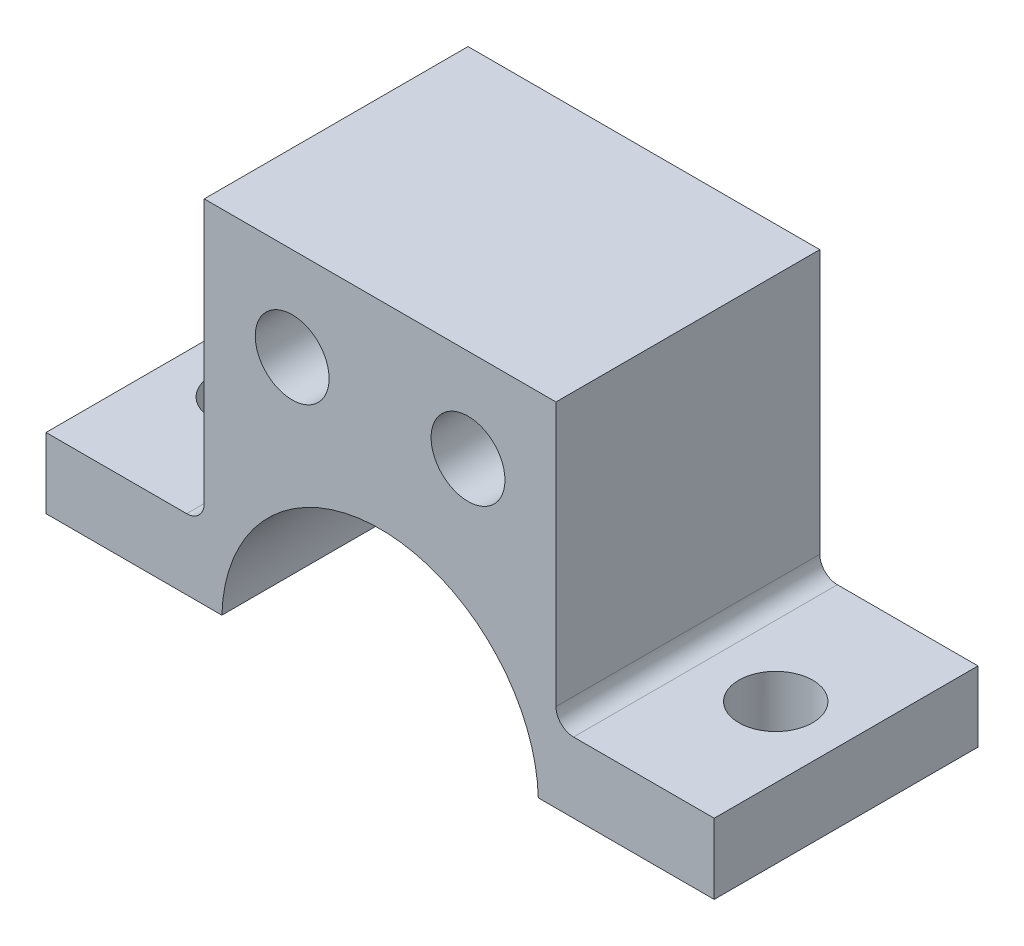
ISO-10303-21;
HEADER;
FILE_DESCRIPTION(('STEP AP214'),'2;1');
FILE_NAME('part.step','',(''),(''),'','','');
FILE_SCHEMA(('AUTOMOTIVE_DESIGN { 1 0 10303 214 1 1 1 1 }'));
ENDSEC;
DATA;
#1=APPLICATION_CONTEXT('core data for automotive mechanical design processes');
#2=APPLICATION_PROTOCOL_DEFINITION('international standard','automotive_design',2000,#1);
#3=PRODUCT_CONTEXT('',#1,'mechanical');
#4=PRODUCT('Part','Part','',(#3));
#5=PRODUCT_RELATED_PRODUCT_CATEGORY('part','',(#4));
#6=PRODUCT_DEFINITION_FORMATION('','',#4);
#7=PRODUCT_DEFINITION_CONTEXT('part definition',#1,'design');
#8=PRODUCT_DEFINITION('design','',#6,#7);
#9=PRODUCT_DEFINITION_SHAPE('','',#8);
#10=(LENGTH_UNIT() NAMED_UNIT(*) SI_UNIT(.MILLI.,.METRE.));
#11=(NAMED_UNIT(*) PLANE_ANGLE_UNIT() SI_UNIT($,.RADIAN.));
#12=(NAMED_UNIT(*) SI_UNIT($,.STERADIAN.) SOLID_ANGLE_UNIT());
#13=UNCERTAINTY_MEASURE_WITH_UNIT(LENGTH_MEASURE(1.E-05),#10,'distance_accuracy_value','');
#14=(GEOMETRIC_REPRESENTATION_CONTEXT(3) GLOBAL_UNCERTAINTY_ASSIGNED_CONTEXT((#13)) GLOBAL_UNIT_ASSIGNED_CONTEXT((#10,
#11,#12)) REPRESENTATION_CONTEXT('',''));
#15=CARTESIAN_POINT('',(0.,0.,0.));
#16=DIRECTION('',(0.,0.,1.));
#17=DIRECTION('',(1.,0.,0.));
#18=AXIS2_PLACEMENT_3D('',#15,#16,#17);
#19=CARTESIAN_POINT('',(9.99999999999999,-20.25,14.9999999999999));
#20=DIRECTION('',(0.,0.,-1.));
#21=DIRECTION('',(-1.00000000000001,0.,0.));
#22=AXIS2_PLACEMENT_3D('',#19,#20,#21);
#23=CYLINDRICAL_SURFACE('',#22,9.);
#24=CARTESIAN_POINT('',(10.,-20.25,0.));
#25=DIRECTION('',(0.,0.,1.));
#26=DIRECTION('',(1.00000000000001,0.,0.));
#27=AXIS2_PLACEMENT_3D('',#24,#25,#26);
#28=CIRCLE('',#27,9.);
#29=CARTESIAN_POINT('',(18.9965271077233,-20.,0.));
#30=VERTEX_POINT('',#29);
#31=CARTESIAN_POINT('',(1.00347289227671,-20.,0.));
#32=VERTEX_POINT('',#31);
#33=EDGE_CURVE('E126',#30,#32,#28,.T.);
#34=ORIENTED_EDGE('',*,*,#33,.F.);
#35=DIRECTION('',(0.,0.,-1.));
#36=VECTOR('',#35,1.);
#37=CARTESIAN_POINT('',(18.9965271077234,-20.,14.9999999999998));
#38=LINE('',#37,#36);
#39=CARTESIAN_POINT('',(18.9965271077234,-20.,14.9999999999998));
#40=VERTEX_POINT('',#39);
#41=EDGE_CURVE('E121',#40,#30,#38,.T.);
#42=ORIENTED_EDGE('',*,*,#41,.F.);
#43=CARTESIAN_POINT('',(9.99999999999999,-20.25,14.9999999999999));
#44=DIRECTION('',(0.,0.,1.));
#45=DIRECTION('',(1.00000000000001,0.,0.));
#46=AXIS2_PLACEMENT_3D('',#43,#44,#45);
#47=CIRCLE('',#46,9.);
#48=CARTESIAN_POINT('',(1.00347289227671,-20.,14.9999999999998));
#49=VERTEX_POINT('',#48);
#50=EDGE_CURVE('E123',#40,#49,#47,.T.);
#51=ORIENTED_EDGE('',*,*,#50,.T.);
#52=DIRECTION('',(0.,0.,-1.));
#53=VECTOR('',#52,1.);
#54=CARTESIAN_POINT('',(1.00347289227671,-20.,14.9999999999998));
#55=LINE('',#54,#53);
#56=EDGE_CURVE('E167',#49,#32,#55,.T.);
#57=ORIENTED_EDGE('',*,*,#56,.T.);
#58=EDGE_LOOP('',(#34,#42,#51,#57));
#59=FACE_BOUND('',#58,.T.);
#60=ADVANCED_FACE('F34',(#59),#23,.F.);
#61=CARTESIAN_POINT('',(0.,-20.,14.9999999999998));
#62=DIRECTION('',(0.,-1.00000000000001,0.));
#63=DIRECTION('',(0.,0.,-1.));
#64=AXIS2_PLACEMENT_3D('',#61,#62,#63);
#65=PLANE('',#64);
#66=CARTESIAN_POINT('',(24.9965271077235,-20.,7.49999999999981));
#67=DIRECTION('',(0.,-1.00000000000001,0.));
#68=DIRECTION('',(0.,0.,-1.));
#69=AXIS2_PLACEMENT_3D('',#66,#67,#68);
#70=CIRCLE('',#69,2.1);
#71=CARTESIAN_POINT('',(24.9965271077235,-20.,5.3999999999998));
#72=VERTEX_POINT('',#71);
#73=EDGE_CURVE('E325',#72,#72,#70,.T.);
#74=ORIENTED_EDGE('',*,*,#73,.F.);
#75=EDGE_LOOP('',(#74));
#76=FACE_BOUND('',#75,.T.);
#77=DIRECTION('',(-1.00000000000001,0.,0.));
#78=VECTOR('',#77,1.);
#79=CARTESIAN_POINT('',(0.,-20.,0.));
#80=LINE('',#79,#78);
#81=CARTESIAN_POINT('',(28.9965271077235,-20.,0.));
#82=VERTEX_POINT('',#81);
#83=EDGE_CURVE('E176',#82,#30,#80,.T.);
#84=ORIENTED_EDGE('',*,*,#83,.F.);
#85=DIRECTION('',(0.,0.,-1.));
#86=VECTOR('',#85,1.);
#87=CARTESIAN_POINT('',(28.9965271077235,-20.,14.9999999999998));
#88=LINE('',#87,#86);
#89=CARTESIAN_POINT('',(28.9965271077235,-20.,14.9999999999998));
#90=VERTEX_POINT('',#89);
#91=EDGE_CURVE('E132',#90,#82,#88,.T.);
#92=ORIENTED_EDGE('',*,*,#91,.F.);
#93=DIRECTION('',(-1.00000000000001,0.,0.));
#94=VECTOR('',#93,1.);
#95=CARTESIAN_POINT('',(0.,-20.,14.9999999999998));
#96=LINE('',#95,#94);
#97=EDGE_CURVE('E138',#90,#40,#96,.T.);
#98=ORIENTED_EDGE('',*,*,#97,.T.);
#99=ORIENTED_EDGE('',*,*,#41,.T.);
#100=EDGE_LOOP('',(#84,#92,#98,#99));
#101=FACE_BOUND('',#100,.T.);
#102=ADVANCED_FACE('F145',(#76,#101),#65,.T.);
#103=CARTESIAN_POINT('',(28.9965271077235,0.,14.9999999999999));
#104=DIRECTION('',(1.00000000000001,0.,0.));
#105=DIRECTION('',(0.,0.,-1.));
#106=AXIS2_PLACEMENT_3D('',#103,#104,#105);
#107=PLANE('',#106);
#108=DIRECTION('',(0.,-1.00000000000001,0.));
#109=VECTOR('',#108,1.);
#110=CARTESIAN_POINT('',(28.9965271077235,0.,0.));
#111=LINE('',#110,#109);
#112=CARTESIAN_POINT('',(28.9965271077235,-16.,0.));
#113=VERTEX_POINT('',#112);
#114=EDGE_CURVE('E178',#113,#82,#111,.T.);
#115=ORIENTED_EDGE('',*,*,#114,.F.);
#116=DIRECTION('',(0.,0.,-1.));
#117=VECTOR('',#116,1.);
#118=CARTESIAN_POINT('',(28.9965271077235,-16.,14.9999999999998));
#119=LINE('',#118,#117);
#120=CARTESIAN_POINT('',(28.9965271077235,-16.,14.9999999999998));
#121=VERTEX_POINT('',#120);
#122=EDGE_CURVE('E210',#121,#113,#119,.T.);
#123=ORIENTED_EDGE('',*,*,#122,.F.);
#124=DIRECTION('',(0.,-1.00000000000001,0.));
#125=VECTOR('',#124,1.);
#126=CARTESIAN_POINT('',(28.9965271077235,0.,14.9999999999999));
#127=LINE('',#126,#125);
#128=EDGE_CURVE('E146',#121,#90,#127,.T.);
#129=ORIENTED_EDGE('',*,*,#128,.T.);
#130=ORIENTED_EDGE('',*,*,#91,.T.);
#131=EDGE_LOOP('',(#115,#123,#129,#130));
#132=FACE_BOUND('',#131,.T.);
#133=ADVANCED_FACE('F247',(#132),#107,.T.);
#134=CARTESIAN_POINT('',(0.,-16.,14.9999999999998));
#135=DIRECTION('',(0.,1.00000000000001,0.));
#136=DIRECTION('',(0.,0.,1.));
#137=AXIS2_PLACEMENT_3D('',#134,#135,#136);
#138=PLANE('',#137);
#139=CARTESIAN_POINT('',(24.9965271077235,-16.,7.49999999999982));
#140=DIRECTION('',(0.,1.00000000000001,0.));
#141=DIRECTION('',(0.,0.,1.));
#142=AXIS2_PLACEMENT_3D('',#139,#140,#141);
#143=CIRCLE('',#142,2.1);
#144=CARTESIAN_POINT('',(24.9965271077235,-16.,9.59999999999982));
#145=VERTEX_POINT('',#144);
#146=EDGE_CURVE('E327',#145,#145,#143,.T.);
#147=ORIENTED_EDGE('',*,*,#146,.F.);
#148=EDGE_LOOP('',(#147));
#149=FACE_BOUND('',#148,.T.);
#150=DIRECTION('',(1.00000000000001,0.,0.));
#151=VECTOR('',#150,1.);
#152=CARTESIAN_POINT('',(0.,-16.,0.));
#153=LINE('',#152,#151);
#154=CARTESIAN_POINT('',(21.,-16.,0.));
#155=VERTEX_POINT('',#154);
#156=EDGE_CURVE('E181',#155,#113,#153,.T.);
#157=ORIENTED_EDGE('',*,*,#156,.F.);
#158=DIRECTION('',(0.,0.,-1.));
#159=VECTOR('',#158,1.);
#160=CARTESIAN_POINT('',(21.0000000000001,-16.,14.9999999999998));
#161=LINE('',#160,#159);
#162=CARTESIAN_POINT('',(21.0000000000001,-16.,14.9999999999998));
#163=VERTEX_POINT('',#162);
#164=EDGE_CURVE('E219',#155,#163,#161,.F.);
#165=ORIENTED_EDGE('',*,*,#164,.T.);
#166=DIRECTION('',(1.00000000000001,0.,0.));
#167=VECTOR('',#166,1.);
#168=CARTESIAN_POINT('',(0.,-16.,14.9999999999998));
#169=LINE('',#168,#167);
#170=EDGE_CURVE('E148',#163,#121,#169,.T.);
#171=ORIENTED_EDGE('',*,*,#170,.T.);
#172=ORIENTED_EDGE('',*,*,#122,.T.);
#173=EDGE_LOOP('',(#157,#165,#171,#172));
#174=FACE_BOUND('',#173,.T.);
#175=ADVANCED_FACE('F243',(#149,#174),#138,.T.);
#176=CARTESIAN_POINT('',(20.0000000000001,0.,14.9999999999999));
#177=DIRECTION('',(-1.00000000000001,0.,0.));
#178=DIRECTION('',(0.,0.,1.));
#179=AXIS2_PLACEMENT_3D('',#176,#177,#178);
#180=PLANE('',#179);
#181=DIRECTION('',(0.,1.00000000000001,0.));
#182=VECTOR('',#181,1.);
#183=CARTESIAN_POINT('',(20.0000000000001,0.,14.9999999999999));
#184=LINE('',#183,#182);
#185=CARTESIAN_POINT('',(20.0000000000001,-15.,14.9999999999998));
#186=VERTEX_POINT('',#185);
#187=CARTESIAN_POINT('',(20.0000000000001,0.,14.9999999999999));
#188=VERTEX_POINT('',#187);
#189=EDGE_CURVE('E153',#186,#188,#184,.T.);
#190=ORIENTED_EDGE('',*,*,#189,.F.);
#191=DIRECTION('',(0.,0.,-1.));
#192=VECTOR('',#191,1.);
#193=CARTESIAN_POINT('',(20.0000000000001,-15.,14.9999999999998));
#194=LINE('',#193,#192);
#195=CARTESIAN_POINT('',(20.,-15.,0.));
#196=VERTEX_POINT('',#195);
#197=EDGE_CURVE('E131',#186,#196,#194,.T.);
#198=ORIENTED_EDGE('',*,*,#197,.T.);
#199=DIRECTION('',(0.,1.00000000000001,0.));
#200=VECTOR('',#199,1.);
#201=CARTESIAN_POINT('',(20.,0.,0.));
#202=LINE('',#201,#200);
#203=CARTESIAN_POINT('',(20.,0.,0.));
#204=VERTEX_POINT('',#203);
#205=EDGE_CURVE('E183',#196,#204,#202,.T.);
#206=ORIENTED_EDGE('',*,*,#205,.T.);
#207=DIRECTION('',(0.,0.,-1.));
#208=VECTOR('',#207,1.);
#209=CARTESIAN_POINT('',(20.0000000000001,0.,14.9999999999999));
#210=LINE('',#209,#208);
#211=EDGE_CURVE('E207',#188,#204,#210,.T.);
#212=ORIENTED_EDGE('',*,*,#211,.F.);
#213=EDGE_LOOP('',(#190,#198,#206,#212));
#214=FACE_BOUND('',#213,.T.);
#215=ADVANCED_FACE('F237',(#214),#180,.F.);
#216=CARTESIAN_POINT('',(0.,0.,14.9999999999998));
#217=DIRECTION('',(0.,1.00000000000001,0.));
#218=DIRECTION('',(0.,0.,1.));
#219=AXIS2_PLACEMENT_3D('',#216,#217,#218);
#220=PLANE('',#219);
#221=DIRECTION('',(1.00000000000001,0.,0.));
#222=VECTOR('',#221,1.);
#223=CARTESIAN_POINT('',(0.,0.,0.));
#224=LINE('',#223,#222);
#225=CARTESIAN_POINT('',(0.,0.,0.));
#226=VERTEX_POINT('',#225);
#227=EDGE_CURVE('E185',#226,#204,#224,.T.);
#228=ORIENTED_EDGE('',*,*,#227,.F.);
#229=DIRECTION('',(0.,0.,-1.));
#230=VECTOR('',#229,1.);
#231=CARTESIAN_POINT('',(0.,0.,14.9999999999998));
#232=LINE('',#231,#230);
#233=CARTESIAN_POINT('',(0.,0.,14.9999999999998));
#234=VERTEX_POINT('',#233);
#235=EDGE_CURVE('E204',#234,#226,#232,.T.);
#236=ORIENTED_EDGE('',*,*,#235,.F.);
#237=DIRECTION('',(1.00000000000001,0.,0.));
#238=VECTOR('',#237,1.);
#239=CARTESIAN_POINT('',(0.,0.,14.9999999999998));
#240=LINE('',#239,#238);
#241=EDGE_CURVE('E155',#234,#188,#240,.T.);
#242=ORIENTED_EDGE('',*,*,#241,.T.);
#243=ORIENTED_EDGE('',*,*,#211,.T.);
#244=EDGE_LOOP('',(#228,#236,#242,#243));
#245=FACE_BOUND('',#244,.T.);
#246=ADVANCED_FACE('F265',(#245),#220,.T.);
#247=CARTESIAN_POINT('',(0.,0.,14.9999999999998));
#248=DIRECTION('',(-1.00000000000001,0.,0.));
#249=DIRECTION('',(0.,0.,1.));
#250=AXIS2_PLACEMENT_3D('',#247,#248,#249);
#251=PLANE('',#250);
#252=DIRECTION('',(0.,1.00000000000001,0.));
#253=VECTOR('',#252,1.);
#254=CARTESIAN_POINT('',(0.,0.,0.));
#255=LINE('',#254,#253);
#256=CARTESIAN_POINT('',(0.,-15.,0.));
#257=VERTEX_POINT('',#256);
#258=EDGE_CURVE('E188',#257,#226,#255,.T.);
#259=ORIENTED_EDGE('',*,*,#258,.F.);
#260=DIRECTION('',(0.,0.,-1.));
#261=VECTOR('',#260,1.);
#262=CARTESIAN_POINT('',(0.,-15.,14.9999999999998));
#263=LINE('',#262,#261);
#264=CARTESIAN_POINT('',(0.,-15.,14.9999999999998));
#265=VERTEX_POINT('',#264);
#266=EDGE_CURVE('E49',#257,#265,#263,.F.);
#267=ORIENTED_EDGE('',*,*,#266,.T.);
#268=DIRECTION('',(0.,1.00000000000001,0.));
#269=VECTOR('',#268,1.);
#270=CARTESIAN_POINT('',(0.,0.,14.9999999999998));
#271=LINE('',#270,#269);
#272=EDGE_CURVE('E158',#265,#234,#271,.T.);
#273=ORIENTED_EDGE('',*,*,#272,.T.);
#274=ORIENTED_EDGE('',*,*,#235,.T.);
#275=EDGE_LOOP('',(#259,#267,#273,#274));
#276=FACE_BOUND('',#275,.T.);
#277=ADVANCED_FACE('F262',(#276),#251,.T.);
#278=CARTESIAN_POINT('',(0.,-16.,14.9999999999998));
#279=DIRECTION('',(0.,1.00000000000001,0.));
#280=DIRECTION('',(0.,0.,1.));
#281=AXIS2_PLACEMENT_3D('',#278,#279,#280);
#282=PLANE('',#281);
#283=CARTESIAN_POINT('',(-4.9965271077233,-16.,7.49999999999981));
#284=DIRECTION('',(0.,1.00000000000001,0.));
#285=DIRECTION('',(0.,0.,1.));
#286=AXIS2_PLACEMENT_3D('',#283,#284,#285);
#287=CIRCLE('',#286,2.1);
#288=CARTESIAN_POINT('',(-4.9965271077233,-16.,9.59999999999981));
#289=VERTEX_POINT('',#288);
#290=EDGE_CURVE('E216',#289,#289,#287,.T.);
#291=ORIENTED_EDGE('',*,*,#290,.F.);
#292=EDGE_LOOP('',(#291));
#293=FACE_BOUND('',#292,.T.);
#294=DIRECTION('',(1.00000000000001,0.,0.));
#295=VECTOR('',#294,1.);
#296=CARTESIAN_POINT('',(0.,-16.,14.9999999999998));
#297=LINE('',#296,#295);
#298=CARTESIAN_POINT('',(-8.9965271077233,-16.,14.9999999999998));
#299=VERTEX_POINT('',#298);
#300=CARTESIAN_POINT('',(-1.,-16.,14.9999999999998));
#301=VERTEX_POINT('',#300);
#302=EDGE_CURVE('E160',#299,#301,#297,.T.);
#303=ORIENTED_EDGE('',*,*,#302,.T.);
#304=DIRECTION('',(0.,0.,-1.));
#305=VECTOR('',#304,1.);
#306=CARTESIAN_POINT('',(-1.,-16.,0.));
#307=LINE('',#306,#305);
#308=CARTESIAN_POINT('',(-1.,-16.,0.));
#309=VERTEX_POINT('',#308);
#310=EDGE_CURVE('E221',#301,#309,#307,.T.);
#311=ORIENTED_EDGE('',*,*,#310,.T.);
#312=DIRECTION('',(1.00000000000001,0.,0.));
#313=VECTOR('',#312,1.);
#314=CARTESIAN_POINT('',(0.,-16.,0.));
#315=LINE('',#314,#313);
#316=CARTESIAN_POINT('',(-8.9965271077233,-16.,0.));
#317=VERTEX_POINT('',#316);
#318=EDGE_CURVE('E190',#317,#309,#315,.T.);
#319=ORIENTED_EDGE('',*,*,#318,.F.);
#320=DIRECTION('',(0.,0.,-1.));
#321=VECTOR('',#320,1.);
#322=CARTESIAN_POINT('',(-8.9965271077233,-16.,14.9999999999998));
#323=LINE('',#322,#321);
#324=EDGE_CURVE('E202',#299,#317,#323,.T.);
#325=ORIENTED_EDGE('',*,*,#324,.F.);
#326=EDGE_LOOP('',(#303,#311,#319,#325));
#327=FACE_BOUND('',#326,.T.);
#328=ADVANCED_FACE('F256',(#293,#327),#282,.T.);
#329=CARTESIAN_POINT('',(-8.9965271077233,0.,14.9999999999998));
#330=DIRECTION('',(-1.00000000000001,0.,0.));
#331=DIRECTION('',(0.,0.,1.));
#332=AXIS2_PLACEMENT_3D('',#329,#330,#331);
#333=PLANE('',#332);
#334=DIRECTION('',(0.,1.00000000000001,0.));
#335=VECTOR('',#334,1.);
#336=CARTESIAN_POINT('',(-8.9965271077233,0.,0.));
#337=LINE('',#336,#335);
#338=CARTESIAN_POINT('',(-8.9965271077233,-20.,0.));
#339=VERTEX_POINT('',#338);
#340=EDGE_CURVE('E192',#339,#317,#337,.T.);
#341=ORIENTED_EDGE('',*,*,#340,.F.);
#342=DIRECTION('',(0.,0.,-1.));
#343=VECTOR('',#342,1.);
#344=CARTESIAN_POINT('',(-8.9965271077233,-20.,14.9999999999998));
#345=LINE('',#344,#343);
#346=CARTESIAN_POINT('',(-8.9965271077233,-20.,14.9999999999998));
#347=VERTEX_POINT('',#346);
#348=EDGE_CURVE('E200',#347,#339,#345,.T.);
#349=ORIENTED_EDGE('',*,*,#348,.F.);
#350=DIRECTION('',(0.,1.00000000000001,0.));
#351=VECTOR('',#350,1.);
#352=CARTESIAN_POINT('',(-8.9965271077233,0.,14.9999999999998));
#353=LINE('',#352,#351);
#354=EDGE_CURVE('E163',#347,#299,#353,.T.);
#355=ORIENTED_EDGE('',*,*,#354,.T.);
#356=ORIENTED_EDGE('',*,*,#324,.T.);
#357=EDGE_LOOP('',(#341,#349,#355,#356));
#358=FACE_BOUND('',#357,.T.);
#359=ADVANCED_FACE('F253',(#358),#333,.T.);
#360=CARTESIAN_POINT('',(5.,-5.3,15.));
#361=DIRECTION('',(0.,0.,-1.));
#362=DIRECTION('',(-1.00000000000001,0.,0.));
#363=AXIS2_PLACEMENT_3D('',#360,#361,#362);
#364=CYLINDRICAL_SURFACE('',#363,2.1);
#365=CARTESIAN_POINT('',(5.,-5.3,15.));
#366=DIRECTION('',(0.,0.,1.));
#367=DIRECTION('',(1.00000000000001,0.,0.));
#368=AXIS2_PLACEMENT_3D('',#365,#366,#367);
#369=CIRCLE('',#368,2.1);
#370=CARTESIAN_POINT('',(7.10000000000002,-5.3,15.));
#371=VERTEX_POINT('',#370);
#372=EDGE_CURVE('E143',#371,#371,#369,.T.);
#373=ORIENTED_EDGE('',*,*,#372,.T.);
#374=EDGE_LOOP('',(#373));
#375=FACE_BOUND('',#374,.T.);
#376=CARTESIAN_POINT('',(5.00000000000001,-5.3,0.));
#377=DIRECTION('',(0.,0.,1.));
#378=DIRECTION('',(1.00000000000001,0.,0.));
#379=AXIS2_PLACEMENT_3D('',#376,#377,#378);
#380=CIRCLE('',#379,2.1);
#381=CARTESIAN_POINT('',(7.10000000000002,-5.3,0.));
#382=VERTEX_POINT('',#381);
#383=EDGE_CURVE('E171',#382,#382,#380,.T.);
#384=ORIENTED_EDGE('',*,*,#383,.F.);
#385=EDGE_LOOP('',(#384));
#386=FACE_BOUND('',#385,.T.);
#387=ADVANCED_FACE('F283',(#375,#386),#364,.F.);
#388=CARTESIAN_POINT('',(15.0000000000001,-5.3,14.9999999999998));
#389=DIRECTION('',(0.,0.,-1.));
#390=DIRECTION('',(-1.00000000000001,0.,0.));
#391=AXIS2_PLACEMENT_3D('',#388,#389,#390);
#392=CYLINDRICAL_SURFACE('',#391,2.1);
#393=CARTESIAN_POINT('',(15.0000000000001,-5.3,14.9999999999998));
#394=DIRECTION('',(0.,0.,1.));
#395=DIRECTION('',(1.00000000000001,0.,0.));
#396=AXIS2_PLACEMENT_3D('',#393,#394,#395);
#397=CIRCLE('',#396,2.1);
#398=CARTESIAN_POINT('',(17.1000000000001,-5.3,14.9999999999998));
#399=VERTEX_POINT('',#398);
#400=EDGE_CURVE('E198',#399,#399,#397,.T.);
#401=ORIENTED_EDGE('',*,*,#400,.T.);
#402=EDGE_LOOP('',(#401));
#403=FACE_BOUND('',#402,.T.);
#404=CARTESIAN_POINT('',(15.0000000000001,-5.3,0.));
#405=DIRECTION('',(0.,0.,1.));
#406=DIRECTION('',(1.00000000000001,0.,0.));
#407=AXIS2_PLACEMENT_3D('',#404,#405,#406);
#408=CIRCLE('',#407,2.1);
#409=CARTESIAN_POINT('',(17.1000000000001,-5.3,0.));
#410=VERTEX_POINT('',#409);
#411=EDGE_CURVE('E168',#410,#410,#408,.T.);
#412=ORIENTED_EDGE('',*,*,#411,.F.);
#413=EDGE_LOOP('',(#412));
#414=FACE_BOUND('',#413,.T.);
#415=ADVANCED_FACE('F286',(#403,#414),#392,.F.);
#416=CARTESIAN_POINT('',(0.,-20.,14.9999999999998));
#417=DIRECTION('',(0.,-1.00000000000001,0.));
#418=DIRECTION('',(0.,0.,-1.));
#419=AXIS2_PLACEMENT_3D('',#416,#417,#418);
#420=PLANE('',#419);
#421=CARTESIAN_POINT('',(-4.9965271077233,-20.,7.49999999999981));
#422=DIRECTION('',(0.,-1.00000000000001,0.));
#423=DIRECTION('',(0.,0.,-1.));
#424=AXIS2_PLACEMENT_3D('',#421,#422,#423);
#425=CIRCLE('',#424,2.1);
#426=CARTESIAN_POINT('',(-4.9965271077233,-20.,5.3999999999998));
#427=VERTEX_POINT('',#426);
#428=EDGE_CURVE('E172',#427,#427,#425,.T.);
#429=ORIENTED_EDGE('',*,*,#428,.F.);
#430=EDGE_LOOP('',(#429));
#431=FACE_BOUND('',#430,.T.);
#432=DIRECTION('',(-1.00000000000001,0.,0.));
#433=VECTOR('',#432,1.);
#434=CARTESIAN_POINT('',(0.,-20.,0.));
#435=LINE('',#434,#433);
#436=EDGE_CURVE('E195',#32,#339,#435,.T.);
#437=ORIENTED_EDGE('',*,*,#436,.F.);
#438=ORIENTED_EDGE('',*,*,#56,.F.);
#439=DIRECTION('',(-1.00000000000001,0.,0.));
#440=VECTOR('',#439,1.);
#441=CARTESIAN_POINT('',(0.,-20.,14.9999999999998));
#442=LINE('',#441,#440);
#443=EDGE_CURVE('E142',#49,#347,#442,.T.);
#444=ORIENTED_EDGE('',*,*,#443,.T.);
#445=ORIENTED_EDGE('',*,*,#348,.T.);
#446=EDGE_LOOP('',(#437,#438,#444,#445));
#447=FACE_BOUND('',#446,.T.);
#448=ADVANCED_FACE('F250',(#431,#447),#420,.T.);
#449=CARTESIAN_POINT('',(0.,0.,14.9999999999998));
#450=DIRECTION('',(0.,0.,1.));
#451=DIRECTION('',(1.00000000000001,0.,0.));
#452=AXIS2_PLACEMENT_3D('',#449,#450,#451);
#453=PLANE('',#452);
#454=ORIENTED_EDGE('',*,*,#400,.F.);
#455=EDGE_LOOP('',(#454));
#456=FACE_BOUND('',#455,.T.);
#457=ORIENTED_EDGE('',*,*,#372,.F.);
#458=EDGE_LOOP('',(#457));
#459=FACE_BOUND('',#458,.T.);
#460=ORIENTED_EDGE('',*,*,#50,.F.);
#461=ORIENTED_EDGE('',*,*,#97,.F.);
#462=ORIENTED_EDGE('',*,*,#128,.F.);
#463=ORIENTED_EDGE('',*,*,#170,.F.);
#464=CARTESIAN_POINT('',(21.0000000000001,-15.,14.9999999999998));
#465=DIRECTION('',(0.,0.,1.));
#466=DIRECTION('',(1.00000000000001,0.,0.));
#467=AXIS2_PLACEMENT_3D('',#464,#465,#466);
#468=CIRCLE('',#467,1.);
#469=EDGE_CURVE('E227',#163,#186,#468,.F.);
#470=ORIENTED_EDGE('',*,*,#469,.T.);
#471=ORIENTED_EDGE('',*,*,#189,.T.);
#472=ORIENTED_EDGE('',*,*,#241,.F.);
#473=ORIENTED_EDGE('',*,*,#272,.F.);
#474=CARTESIAN_POINT('',(-1.,-15.,14.9999999999998));
#475=DIRECTION('',(0.,0.,1.));
#476=DIRECTION('',(1.00000000000001,0.,0.));
#477=AXIS2_PLACEMENT_3D('',#474,#475,#476);
#478=CIRCLE('',#477,1.);
#479=EDGE_CURVE('E11',#265,#301,#478,.F.);
#480=ORIENTED_EDGE('',*,*,#479,.T.);
#481=ORIENTED_EDGE('',*,*,#302,.F.);
#482=ORIENTED_EDGE('',*,*,#354,.F.);
#483=ORIENTED_EDGE('',*,*,#443,.F.);
#484=EDGE_LOOP('',(#460,#461,#462,#463,#470,#471,#472,#473,#480,#481,#482,#483));
#485=FACE_BOUND('',#484,.T.);
#486=ADVANCED_FACE('F136',(#456,#459,#485),#453,.T.);
#487=CARTESIAN_POINT('',(0.,0.,0.));
#488=DIRECTION('',(0.,0.,1.));
#489=DIRECTION('',(1.00000000000001,0.,0.));
#490=AXIS2_PLACEMENT_3D('',#487,#488,#489);
#491=PLANE('',#490);
#492=ORIENTED_EDGE('',*,*,#411,.T.);
#493=EDGE_LOOP('',(#492));
#494=FACE_BOUND('',#493,.T.);
#495=ORIENTED_EDGE('',*,*,#383,.T.);
#496=EDGE_LOOP('',(#495));
#497=FACE_BOUND('',#496,.T.);
#498=ORIENTED_EDGE('',*,*,#33,.T.);
#499=ORIENTED_EDGE('',*,*,#436,.T.);
#500=ORIENTED_EDGE('',*,*,#340,.T.);
#501=ORIENTED_EDGE('',*,*,#318,.T.);
#502=CARTESIAN_POINT('',(-1.,-15.,0.));
#503=DIRECTION('',(0.,0.,1.));
#504=DIRECTION('',(1.00000000000001,0.,0.));
#505=AXIS2_PLACEMENT_3D('',#502,#503,#504);
#506=CIRCLE('',#505,1.);
#507=EDGE_CURVE('E42',#309,#257,#506,.T.);
#508=ORIENTED_EDGE('',*,*,#507,.T.);
#509=ORIENTED_EDGE('',*,*,#258,.T.);
#510=ORIENTED_EDGE('',*,*,#227,.T.);
#511=ORIENTED_EDGE('',*,*,#205,.F.);
#512=CARTESIAN_POINT('',(21.,-15.,0.));
#513=DIRECTION('',(0.,0.,1.));
#514=DIRECTION('',(1.00000000000001,0.,0.));
#515=AXIS2_PLACEMENT_3D('',#512,#513,#514);
#516=CIRCLE('',#515,1.);
#517=EDGE_CURVE('E225',#196,#155,#516,.T.);
#518=ORIENTED_EDGE('',*,*,#517,.T.);
#519=ORIENTED_EDGE('',*,*,#156,.T.);
#520=ORIENTED_EDGE('',*,*,#114,.T.);
#521=ORIENTED_EDGE('',*,*,#83,.T.);
#522=EDGE_LOOP('',(#498,#499,#500,#501,#508,#509,#510,#511,#518,#519,#520,#521));
#523=FACE_BOUND('',#522,.T.);
#524=ADVANCED_FACE('F241',(#494,#497,#523),#491,.F.);
#525=CARTESIAN_POINT('',(-4.9965271077233,-26.0000000000004,7.49999999999981));
#526=DIRECTION('',(0.,1.00000000000001,0.));
#527=DIRECTION('',(0.,0.,1.));
#528=AXIS2_PLACEMENT_3D('',#525,#526,#527);
#529=CYLINDRICAL_SURFACE('',#528,2.1);
#530=ORIENTED_EDGE('',*,*,#428,.T.);
#531=EDGE_LOOP('',(#530));
#532=FACE_BOUND('',#531,.T.);
#533=ORIENTED_EDGE('',*,*,#290,.T.);
#534=EDGE_LOOP('',(#533));
#535=FACE_BOUND('',#534,.T.);
#536=ADVANCED_FACE('F296',(#532,#535),#529,.F.);
#537=CARTESIAN_POINT('',(24.9965271077235,-26.0000000000002,7.49999999999982));
#538=DIRECTION('',(0.,1.00000000000001,0.));
#539=DIRECTION('',(0.,0.,1.));
#540=AXIS2_PLACEMENT_3D('',#537,#538,#539);
#541=CYLINDRICAL_SURFACE('',#540,2.1);
#542=ORIENTED_EDGE('',*,*,#73,.T.);
#543=EDGE_LOOP('',(#542));
#544=FACE_BOUND('',#543,.T.);
#545=ORIENTED_EDGE('',*,*,#146,.T.);
#546=EDGE_LOOP('',(#545));
#547=FACE_BOUND('',#546,.T.);
#548=ADVANCED_FACE('F291',(#544,#547),#541,.F.);
#549=CARTESIAN_POINT('',(21.0000000000001,-15.,14.9999999999998));
#550=DIRECTION('',(0.,0.,-1.));
#551=DIRECTION('',(-1.00000000000001,0.,0.));
#552=AXIS2_PLACEMENT_3D('',#549,#550,#551);
#553=CYLINDRICAL_SURFACE('',#552,1.);
#554=ORIENTED_EDGE('',*,*,#469,.F.);
#555=ORIENTED_EDGE('',*,*,#164,.F.);
#556=ORIENTED_EDGE('',*,*,#517,.F.);
#557=ORIENTED_EDGE('',*,*,#197,.F.);
#558=EDGE_LOOP('',(#554,#555,#556,#557));
#559=FACE_BOUND('',#558,.T.);
#560=ADVANCED_FACE('F239',(#559),#553,.F.);
#561=CARTESIAN_POINT('',(-1.,-15.,14.9999999999998));
#562=DIRECTION('',(0.,0.,1.));
#563=DIRECTION('',(1.00000000000001,0.,0.));
#564=AXIS2_PLACEMENT_3D('',#561,#562,#563);
#565=CYLINDRICAL_SURFACE('',#564,1.);
#566=ORIENTED_EDGE('',*,*,#479,.F.);
#567=ORIENTED_EDGE('',*,*,#266,.F.);
#568=ORIENTED_EDGE('',*,*,#507,.F.);
#569=ORIENTED_EDGE('',*,*,#310,.F.);
#570=EDGE_LOOP('',(#566,#567,#568,#569));
#571=FACE_BOUND('',#570,.T.);
#572=ADVANCED_FACE('F36',(#571),#565,.F.);
#573=CLOSED_SHELL('',(#60,#102,#133,#175,#215,#246,#277,#328,#359,#387,#415,#448,#486,#524,#536,
#548,#560,#572));
#574=MANIFOLD_SOLID_BREP('B2',#573);
#575=ADVANCED_BREP_SHAPE_REPRESENTATION('',(#18,#574),#14);
#576=SHAPE_DEFINITION_REPRESENTATION(#9,#575);
ENDSEC;
END-ISO-10303-21;
